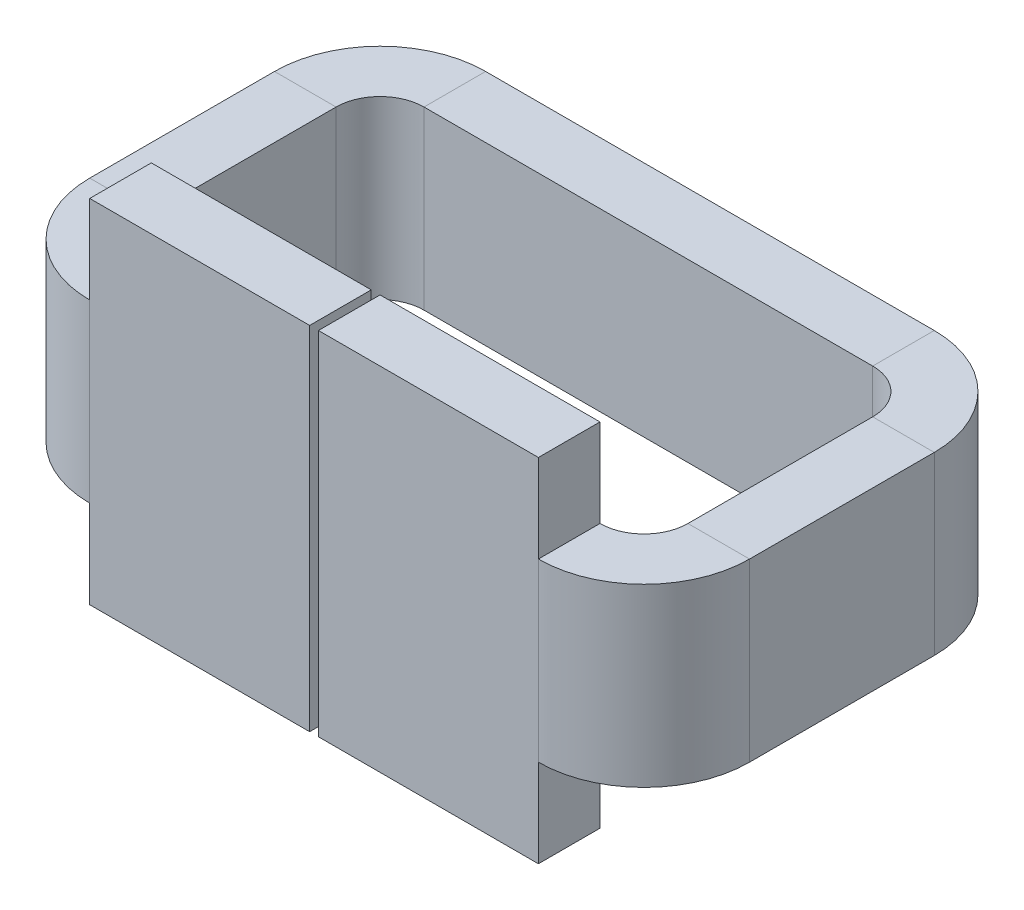
ISO-10303-21;
HEADER;
FILE_DESCRIPTION(('STEP AP214'),'2;1');
FILE_NAME('part.step','',(''),(''),'','','');
FILE_SCHEMA(('AUTOMOTIVE_DESIGN { 1 0 10303 214 1 1 1 1 }'));
ENDSEC;
DATA;
#1=APPLICATION_CONTEXT('core data for automotive mechanical design processes');
#2=APPLICATION_PROTOCOL_DEFINITION('international standard','automotive_design',2000,#1);
#3=PRODUCT_CONTEXT('',#1,'mechanical');
#4=PRODUCT('Part','Part','',(#3));
#5=PRODUCT_RELATED_PRODUCT_CATEGORY('part','',(#4));
#6=PRODUCT_DEFINITION_FORMATION('','',#4);
#7=PRODUCT_DEFINITION_CONTEXT('part definition',#1,'design');
#8=PRODUCT_DEFINITION('design','',#6,#7);
#9=PRODUCT_DEFINITION_SHAPE('','',#8);
#10=(LENGTH_UNIT() NAMED_UNIT(*) SI_UNIT(.MILLI.,.METRE.));
#11=(NAMED_UNIT(*) PLANE_ANGLE_UNIT() SI_UNIT($,.RADIAN.));
#12=(NAMED_UNIT(*) SI_UNIT($,.STERADIAN.) SOLID_ANGLE_UNIT());
#13=UNCERTAINTY_MEASURE_WITH_UNIT(LENGTH_MEASURE(1.E-05),#10,'distance_accuracy_value','');
#14=(GEOMETRIC_REPRESENTATION_CONTEXT(3) GLOBAL_UNCERTAINTY_ASSIGNED_CONTEXT((#13)) GLOBAL_UNIT_ASSIGNED_CONTEXT((#10,
#11,#12)) REPRESENTATION_CONTEXT('',''));
#15=CARTESIAN_POINT('',(0.,0.,0.));
#16=DIRECTION('',(0.,0.,1.));
#17=DIRECTION('',(1.,0.,0.));
#18=AXIS2_PLACEMENT_3D('',#15,#16,#17);
#19=CARTESIAN_POINT('',(3.7186584278201,0.50894488,-3.90652));
#20=DIRECTION('',(0.,-1.,0.));
#21=DIRECTION('',(1.,0.,0.));
#22=AXIS2_PLACEMENT_3D('',#19,#20,#21);
#23=PLANE('',#22);
#24=DIRECTION('',(0.,0.,-1.));
#25=VECTOR('',#24,1.);
#26=CARTESIAN_POINT('',(-1.29548128,0.508944879999999,-3.55092));
#27=LINE('',#26,#25);
#28=CARTESIAN_POINT('',(-1.29548128,0.508944879999999,-3.55092));
#29=VERTEX_POINT('',#28);
#30=CARTESIAN_POINT('',(-1.29548128,0.508944879999999,-3.90652));
#31=VERTEX_POINT('',#30);
#32=EDGE_CURVE('E10',#29,#31,#27,.T.);
#33=ORIENTED_EDGE('',*,*,#32,.F.);
#34=DIRECTION('',(1.,0.,0.));
#35=VECTOR('',#34,1.);
#36=CARTESIAN_POINT('',(3.7186584278201,0.50894488,-3.55092));
#37=LINE('',#36,#35);
#38=CARTESIAN_POINT('',(1.29531872,0.508944879999999,-3.55092));
#39=VERTEX_POINT('',#38);
#40=EDGE_CURVE('E23',#29,#39,#37,.T.);
#41=ORIENTED_EDGE('',*,*,#40,.T.);
#42=DIRECTION('',(0.,0.,1.));
#43=VECTOR('',#42,1.);
#44=CARTESIAN_POINT('',(1.29531872,0.508944879999999,-3.90652));
#45=LINE('',#44,#43);
#46=CARTESIAN_POINT('',(1.29531872,0.508944879999999,-3.90652));
#47=VERTEX_POINT('',#46);
#48=EDGE_CURVE('E411',#47,#39,#45,.T.);
#49=ORIENTED_EDGE('',*,*,#48,.F.);
#50=DIRECTION('',(1.,0.,0.));
#51=VECTOR('',#50,1.);
#52=CARTESIAN_POINT('',(3.7186584278201,0.50894488,-3.90652));
#53=LINE('',#52,#51);
#54=EDGE_CURVE('E408',#31,#47,#53,.T.);
#55=ORIENTED_EDGE('',*,*,#54,.F.);
#56=EDGE_LOOP('',(#33,#41,#49,#55));
#57=FACE_BOUND('',#56,.T.);
#58=ADVANCED_FACE('F16',(#57),#23,.F.);
#59=CARTESIAN_POINT('',(3.7186584278201,-0.507055120000001,-3.90652));
#60=DIRECTION('',(0.,1.,0.));
#61=DIRECTION('',(-1.,0.,0.));
#62=AXIS2_PLACEMENT_3D('',#59,#60,#61);
#63=PLANE('',#62);
#64=DIRECTION('',(0.,0.,1.));
#65=VECTOR('',#64,1.);
#66=CARTESIAN_POINT('',(-1.29548128,-0.507055120000001,-3.90652));
#67=LINE('',#66,#65);
#68=CARTESIAN_POINT('',(-1.29548128,-0.507055120000001,-3.90652));
#69=VERTEX_POINT('',#68);
#70=CARTESIAN_POINT('',(-1.29548128,-0.507055120000001,-3.55092));
#71=VERTEX_POINT('',#70);
#72=EDGE_CURVE('E405',#69,#71,#67,.T.);
#73=ORIENTED_EDGE('',*,*,#72,.F.);
#74=DIRECTION('',(-1.,0.,0.));
#75=VECTOR('',#74,1.);
#76=CARTESIAN_POINT('',(3.7186584278201,-0.507055120000001,-3.90652));
#77=LINE('',#76,#75);
#78=CARTESIAN_POINT('',(1.29531872,-0.507055120000001,-3.90652));
#79=VERTEX_POINT('',#78);
#80=EDGE_CURVE('E403',#79,#69,#77,.T.);
#81=ORIENTED_EDGE('',*,*,#80,.F.);
#82=DIRECTION('',(0.,0.,-1.));
#83=VECTOR('',#82,1.);
#84=CARTESIAN_POINT('',(1.29531872,-0.507055120000001,-3.55092));
#85=LINE('',#84,#83);
#86=CARTESIAN_POINT('',(1.29531872,-0.507055120000001,-3.55092));
#87=VERTEX_POINT('',#86);
#88=EDGE_CURVE('E400',#87,#79,#85,.T.);
#89=ORIENTED_EDGE('',*,*,#88,.F.);
#90=DIRECTION('',(-1.,0.,0.));
#91=VECTOR('',#90,1.);
#92=CARTESIAN_POINT('',(3.7186584278201,-0.50705512,-3.55092));
#93=LINE('',#92,#91);
#94=EDGE_CURVE('E397',#87,#71,#93,.T.);
#95=ORIENTED_EDGE('',*,*,#94,.T.);
#96=EDGE_LOOP('',(#73,#81,#89,#95));
#97=FACE_BOUND('',#96,.T.);
#98=ADVANCED_FACE('F468',(#97),#63,.F.);
#99=CARTESIAN_POINT('',(1.29531872,1.01694488,-3.90652));
#100=DIRECTION('',(0.,0.,-1.));
#101=DIRECTION('',(-1.,0.,0.));
#102=AXIS2_PLACEMENT_3D('',#99,#100,#101);
#103=PLANE('',#102);
#104=ORIENTED_EDGE('',*,*,#80,.T.);
#105=DIRECTION('',(0.,-1.,0.));
#106=VECTOR('',#105,1.);
#107=CARTESIAN_POINT('',(-1.29548128,1.01694488,-3.90652));
#108=LINE('',#107,#106);
#109=EDGE_CURVE('E394',#31,#69,#108,.T.);
#110=ORIENTED_EDGE('',*,*,#109,.F.);
#111=ORIENTED_EDGE('',*,*,#54,.T.);
#112=DIRECTION('',(0.,-1.,0.));
#113=VECTOR('',#112,1.);
#114=CARTESIAN_POINT('',(1.29531872,1.01694488,-3.90652));
#115=LINE('',#114,#113);
#116=EDGE_CURVE('E391',#47,#79,#115,.T.);
#117=ORIENTED_EDGE('',*,*,#116,.T.);
#118=EDGE_LOOP('',(#104,#110,#111,#117));
#119=FACE_BOUND('',#118,.T.);
#120=ADVANCED_FACE('F444',(#119),#103,.T.);
#121=CARTESIAN_POINT('',(1.29531872,1.01694488,-3.55092));
#122=DIRECTION('',(0.,0.,-1.));
#123=DIRECTION('',(-1.,0.,0.));
#124=AXIS2_PLACEMENT_3D('',#121,#122,#123);
#125=PLANE('',#124);
#126=DIRECTION('',(0.,-1.,0.));
#127=VECTOR('',#126,1.);
#128=CARTESIAN_POINT('',(-1.29548128,1.01694488,-3.55092));
#129=LINE('',#128,#127);
#130=EDGE_CURVE('E388',#29,#71,#129,.T.);
#131=ORIENTED_EDGE('',*,*,#130,.T.);
#132=ORIENTED_EDGE('',*,*,#94,.F.);
#133=DIRECTION('',(0.,-1.,0.));
#134=VECTOR('',#133,1.);
#135=CARTESIAN_POINT('',(1.29531872,1.01694488,-3.55092));
#136=LINE('',#135,#134);
#137=EDGE_CURVE('E386',#39,#87,#136,.T.);
#138=ORIENTED_EDGE('',*,*,#137,.F.);
#139=ORIENTED_EDGE('',*,*,#40,.F.);
#140=EDGE_LOOP('',(#131,#132,#138,#139));
#141=FACE_BOUND('',#140,.T.);
#142=ADVANCED_FACE('F420',(#141),#125,.F.);
#143=CARTESIAN_POINT('',(0.0253187200000003,1.01694488,-1.62052));
#144=DIRECTION('',(-1.,0.,0.));
#145=DIRECTION('',(0.,0.,1.));
#146=AXIS2_PLACEMENT_3D('',#143,#144,#145);
#147=PLANE('',#146);
#148=DIRECTION('',(0.,0.,-1.));
#149=VECTOR('',#148,1.);
#150=CARTESIAN_POINT('',(0.0253187200000003,-1.01505512,-1.62052));
#151=LINE('',#150,#149);
#152=CARTESIAN_POINT('',(0.0253187200000003,-1.01505512,-1.62052));
#153=VERTEX_POINT('',#152);
#154=CARTESIAN_POINT('',(0.0253187200000002,-1.01505512,-1.97612));
#155=VERTEX_POINT('',#154);
#156=EDGE_CURVE('E383',#153,#155,#151,.T.);
#157=ORIENTED_EDGE('',*,*,#156,.F.);
#158=DIRECTION('',(0.,-1.,0.));
#159=VECTOR('',#158,1.);
#160=CARTESIAN_POINT('',(0.0253187200000003,1.01694488,-1.62052));
#161=LINE('',#160,#159);
#162=CARTESIAN_POINT('',(0.0253187200000003,1.01694488,-1.62052));
#163=VERTEX_POINT('',#162);
#164=EDGE_CURVE('E381',#163,#153,#161,.T.);
#165=ORIENTED_EDGE('',*,*,#164,.F.);
#166=DIRECTION('',(0.,0.,-1.));
#167=VECTOR('',#166,1.);
#168=CARTESIAN_POINT('',(0.0253187200000003,1.01694488,-1.62052));
#169=LINE('',#168,#167);
#170=CARTESIAN_POINT('',(0.0253187200000002,1.01694488,-1.97612));
#171=VERTEX_POINT('',#170);
#172=EDGE_CURVE('E379',#163,#171,#169,.T.);
#173=ORIENTED_EDGE('',*,*,#172,.T.);
#174=DIRECTION('',(0.,-1.,0.));
#175=VECTOR('',#174,1.);
#176=CARTESIAN_POINT('',(0.0253187200000002,1.01694488,-1.97612));
#177=LINE('',#176,#175);
#178=EDGE_CURVE('E376',#171,#155,#177,.T.);
#179=ORIENTED_EDGE('',*,*,#178,.T.);
#180=EDGE_LOOP('',(#157,#165,#173,#179));
#181=FACE_BOUND('',#180,.T.);
#182=ADVANCED_FACE('F525',(#181),#147,.T.);
#183=CARTESIAN_POINT('',(1.54931872,1.01694488,-2.23012));
#184=DIRECTION('',(0.,1.,0.));
#185=DIRECTION('',(1.,0.,0.));
#186=AXIS2_PLACEMENT_3D('',#183,#184,#185);
#187=PLANE('',#186);
#188=DIRECTION('',(-1.,0.,0.));
#189=VECTOR('',#188,1.);
#190=CARTESIAN_POINT('',(0.0253187200000003,1.01694488,-1.62052));
#191=LINE('',#190,#189);
#192=CARTESIAN_POINT('',(1.29531872,1.01694488,-1.62052));
#193=VERTEX_POINT('',#192);
#194=EDGE_CURVE('E374',#193,#163,#191,.T.);
#195=ORIENTED_EDGE('',*,*,#194,.F.);
#196=DIRECTION('',(0.,0.,-1.));
#197=VECTOR('',#196,1.);
#198=CARTESIAN_POINT('',(1.29531872,1.01694488,-1.62052));
#199=LINE('',#198,#197);
#200=CARTESIAN_POINT('',(1.29531872,1.01694488,-1.97612));
#201=VERTEX_POINT('',#200);
#202=EDGE_CURVE('E372',#193,#201,#199,.T.);
#203=ORIENTED_EDGE('',*,*,#202,.T.);
#204=DIRECTION('',(-1.,0.,0.));
#205=VECTOR('',#204,1.);
#206=CARTESIAN_POINT('',(0.0253187200000002,1.01694488,-1.97612));
#207=LINE('',#206,#205);
#208=EDGE_CURVE('E369',#201,#171,#207,.T.);
#209=ORIENTED_EDGE('',*,*,#208,.T.);
#210=ORIENTED_EDGE('',*,*,#172,.F.);
#211=EDGE_LOOP('',(#195,#203,#209,#210));
#212=FACE_BOUND('',#211,.T.);
#213=ADVANCED_FACE('F528',(#212),#187,.T.);
#214=CARTESIAN_POINT('',(1.29531872,-1.01505512,-2.23012));
#215=DIRECTION('',(0.,-1.,0.));
#216=DIRECTION('',(-1.,0.,0.));
#217=AXIS2_PLACEMENT_3D('',#214,#215,#216);
#218=PLANE('',#217);
#219=DIRECTION('',(-1.,0.,0.));
#220=VECTOR('',#219,1.);
#221=CARTESIAN_POINT('',(0.0253187200000002,-1.01505512,-1.97612));
#222=LINE('',#221,#220);
#223=CARTESIAN_POINT('',(1.29531872,-1.01505512,-1.97612));
#224=VERTEX_POINT('',#223);
#225=EDGE_CURVE('E367',#224,#155,#222,.T.);
#226=ORIENTED_EDGE('',*,*,#225,.F.);
#227=DIRECTION('',(0.,0.,1.));
#228=VECTOR('',#227,1.);
#229=CARTESIAN_POINT('',(1.29531872,-1.01505512,-1.97612));
#230=LINE('',#229,#228);
#231=CARTESIAN_POINT('',(1.29531872,-1.01505512,-1.62052));
#232=VERTEX_POINT('',#231);
#233=EDGE_CURVE('E365',#224,#232,#230,.T.);
#234=ORIENTED_EDGE('',*,*,#233,.T.);
#235=DIRECTION('',(-1.,0.,0.));
#236=VECTOR('',#235,1.);
#237=CARTESIAN_POINT('',(0.0253187200000003,-1.01505512,-1.62052));
#238=LINE('',#237,#236);
#239=EDGE_CURVE('E362',#232,#153,#238,.T.);
#240=ORIENTED_EDGE('',*,*,#239,.T.);
#241=ORIENTED_EDGE('',*,*,#156,.T.);
#242=EDGE_LOOP('',(#226,#234,#240,#241));
#243=FACE_BOUND('',#242,.T.);
#244=ADVANCED_FACE('F532',(#243),#218,.T.);
#245=CARTESIAN_POINT('',(1.29531872,-1.01505512,-1.62052));
#246=DIRECTION('',(-1.,0.,0.));
#247=DIRECTION('',(0.,1.,0.));
#248=AXIS2_PLACEMENT_3D('',#245,#246,#247);
#249=PLANE('',#248);
#250=DIRECTION('',(0.,1.,0.));
#251=VECTOR('',#250,1.);
#252=CARTESIAN_POINT('',(1.29531872,-1.01505512,-1.97612));
#253=LINE('',#252,#251);
#254=CARTESIAN_POINT('',(1.29531872,-0.50705512,-1.97612));
#255=VERTEX_POINT('',#254);
#256=EDGE_CURVE('E360',#224,#255,#253,.T.);
#257=ORIENTED_EDGE('',*,*,#256,.T.);
#258=DIRECTION('',(0.,0.,-1.));
#259=VECTOR('',#258,1.);
#260=CARTESIAN_POINT('',(1.29531872,-0.50705512,-1.62052));
#261=LINE('',#260,#259);
#262=CARTESIAN_POINT('',(1.29531872,-0.50705512,-1.62052));
#263=VERTEX_POINT('',#262);
#264=EDGE_CURVE('E357',#263,#255,#261,.T.);
#265=ORIENTED_EDGE('',*,*,#264,.F.);
#266=DIRECTION('',(0.,1.,0.));
#267=VECTOR('',#266,1.);
#268=CARTESIAN_POINT('',(1.29531872,-1.01505512,-1.62052));
#269=LINE('',#268,#267);
#270=EDGE_CURVE('E354',#232,#263,#269,.T.);
#271=ORIENTED_EDGE('',*,*,#270,.F.);
#272=ORIENTED_EDGE('',*,*,#233,.F.);
#273=EDGE_LOOP('',(#257,#265,#271,#272));
#274=FACE_BOUND('',#273,.T.);
#275=ADVANCED_FACE('F489',(#274),#249,.F.);
#276=CARTESIAN_POINT('',(0.0253187200000002,1.01694488,-1.97612));
#277=DIRECTION('',(0.,0.,1.));
#278=DIRECTION('',(1.,0.,0.));
#279=AXIS2_PLACEMENT_3D('',#276,#277,#278);
#280=PLANE('',#279);
#281=ORIENTED_EDGE('',*,*,#225,.T.);
#282=ORIENTED_EDGE('',*,*,#178,.F.);
#283=ORIENTED_EDGE('',*,*,#208,.F.);
#284=DIRECTION('',(0.,-1.,0.));
#285=VECTOR('',#284,1.);
#286=CARTESIAN_POINT('',(1.29531872,1.01694488,-1.97612));
#287=LINE('',#286,#285);
#288=CARTESIAN_POINT('',(1.29531872,0.50894488,-1.97612));
#289=VERTEX_POINT('',#288);
#290=EDGE_CURVE('E351',#201,#289,#287,.T.);
#291=ORIENTED_EDGE('',*,*,#290,.T.);
#292=DIRECTION('',(0.,-1.,0.));
#293=VECTOR('',#292,1.);
#294=CARTESIAN_POINT('',(1.29531872,1.01694488,-1.97612));
#295=LINE('',#294,#293);
#296=EDGE_CURVE('E348',#289,#255,#295,.T.);
#297=ORIENTED_EDGE('',*,*,#296,.T.);
#298=ORIENTED_EDGE('',*,*,#256,.F.);
#299=EDGE_LOOP('',(#281,#282,#283,#291,#297,#298));
#300=FACE_BOUND('',#299,.T.);
#301=ADVANCED_FACE('F494',(#300),#280,.F.);
#302=CARTESIAN_POINT('',(1.29531872,1.01694488,-1.62052));
#303=DIRECTION('',(-1.,0.,0.));
#304=DIRECTION('',(0.,1.,0.));
#305=AXIS2_PLACEMENT_3D('',#302,#303,#304);
#306=PLANE('',#305);
#307=ORIENTED_EDGE('',*,*,#290,.F.);
#308=ORIENTED_EDGE('',*,*,#202,.F.);
#309=DIRECTION('',(0.,-1.,0.));
#310=VECTOR('',#309,1.);
#311=CARTESIAN_POINT('',(1.29531872,1.01694488,-1.62052));
#312=LINE('',#311,#310);
#313=CARTESIAN_POINT('',(1.29531872,0.50894488,-1.62052));
#314=VERTEX_POINT('',#313);
#315=EDGE_CURVE('E346',#193,#314,#312,.T.);
#316=ORIENTED_EDGE('',*,*,#315,.T.);
#317=DIRECTION('',(0.,0.,-1.));
#318=VECTOR('',#317,1.);
#319=CARTESIAN_POINT('',(1.29531872,0.50894488,-1.62052));
#320=LINE('',#319,#318);
#321=EDGE_CURVE('E344',#314,#289,#320,.T.);
#322=ORIENTED_EDGE('',*,*,#321,.T.);
#323=EDGE_LOOP('',(#307,#308,#316,#322));
#324=FACE_BOUND('',#323,.T.);
#325=ADVANCED_FACE('F501',(#324),#306,.F.);
#326=CARTESIAN_POINT('',(0.0253187200000003,1.01694488,-1.62052));
#327=DIRECTION('',(0.,0.,1.));
#328=DIRECTION('',(1.,0.,0.));
#329=AXIS2_PLACEMENT_3D('',#326,#327,#328);
#330=PLANE('',#329);
#331=ORIENTED_EDGE('',*,*,#239,.F.);
#332=ORIENTED_EDGE('',*,*,#270,.T.);
#333=DIRECTION('',(0.,-1.,0.));
#334=VECTOR('',#333,1.);
#335=CARTESIAN_POINT('',(1.29531872,1.01694488,-1.62052));
#336=LINE('',#335,#334);
#337=EDGE_CURVE('E341',#314,#263,#336,.T.);
#338=ORIENTED_EDGE('',*,*,#337,.F.);
#339=ORIENTED_EDGE('',*,*,#315,.F.);
#340=ORIENTED_EDGE('',*,*,#194,.T.);
#341=ORIENTED_EDGE('',*,*,#164,.T.);
#342=EDGE_LOOP('',(#331,#332,#338,#339,#340,#341));
#343=FACE_BOUND('',#342,.T.);
#344=ADVANCED_FACE('F485',(#343),#330,.T.);
#345=CARTESIAN_POINT('',(1.29531872,-0.50705512,-2.23012));
#346=DIRECTION('',(0.,-1.,0.));
#347=DIRECTION('',(-1.,0.,0.));
#348=AXIS2_PLACEMENT_3D('',#345,#346,#347);
#349=PLANE('',#348);
#350=ORIENTED_EDGE('',*,*,#264,.T.);
#351=CARTESIAN_POINT('',(1.29531872,-0.50705512,-2.23012));
#352=DIRECTION('',(0.,1.,0.));
#353=DIRECTION('',(1.,0.,0.));
#354=AXIS2_PLACEMENT_3D('',#351,#352,#353);
#355=CIRCLE('',#354,0.254);
#356=CARTESIAN_POINT('',(1.54931872,-0.50705512,-2.23012));
#357=VERTEX_POINT('',#356);
#358=EDGE_CURVE('E338',#255,#357,#355,.T.);
#359=ORIENTED_EDGE('',*,*,#358,.T.);
#360=DIRECTION('',(1.,0.,0.));
#361=VECTOR('',#360,1.);
#362=CARTESIAN_POINT('',(1.54931872,-0.50705512,-2.23012));
#363=LINE('',#362,#361);
#364=CARTESIAN_POINT('',(1.90491872,-0.50705512,-2.23012));
#365=VERTEX_POINT('',#364);
#366=EDGE_CURVE('E335',#357,#365,#363,.T.);
#367=ORIENTED_EDGE('',*,*,#366,.T.);
#368=CARTESIAN_POINT('',(1.29531872,-0.50705512,-2.23012));
#369=DIRECTION('',(0.,1.,0.));
#370=DIRECTION('',(1.,0.,0.));
#371=AXIS2_PLACEMENT_3D('',#368,#369,#370);
#372=CIRCLE('',#371,0.6096);
#373=EDGE_CURVE('E332',#263,#365,#372,.T.);
#374=ORIENTED_EDGE('',*,*,#373,.F.);
#375=EDGE_LOOP('',(#350,#359,#367,#374));
#376=FACE_BOUND('',#375,.T.);
#377=ADVANCED_FACE('F476',(#376),#349,.T.);
#378=CARTESIAN_POINT('',(1.29531872,-1.2713590753201,-2.23012));
#379=DIRECTION('',(0.,1.,0.));
#380=DIRECTION('',(1.,0.,0.));
#381=AXIS2_PLACEMENT_3D('',#378,#379,#380);
#382=CYLINDRICAL_SURFACE('',#381,0.254);
#383=CARTESIAN_POINT('',(1.29531872,0.50894488,-2.23012));
#384=DIRECTION('',(0.,-1.,0.));
#385=DIRECTION('',(1.,0.,0.));
#386=AXIS2_PLACEMENT_3D('',#383,#384,#385);
#387=CIRCLE('',#386,0.254);
#388=CARTESIAN_POINT('',(1.54931872,0.50894488,-2.23012));
#389=VERTEX_POINT('',#388);
#390=EDGE_CURVE('E329',#389,#289,#387,.T.);
#391=ORIENTED_EDGE('',*,*,#390,.F.);
#392=DIRECTION('',(0.,-1.,0.));
#393=VECTOR('',#392,1.);
#394=CARTESIAN_POINT('',(1.54931872,1.01694488,-2.23012));
#395=LINE('',#394,#393);
#396=EDGE_CURVE('E326',#389,#357,#395,.T.);
#397=ORIENTED_EDGE('',*,*,#396,.T.);
#398=ORIENTED_EDGE('',*,*,#358,.F.);
#399=ORIENTED_EDGE('',*,*,#296,.F.);
#400=EDGE_LOOP('',(#391,#397,#398,#399));
#401=FACE_BOUND('',#400,.T.);
#402=ADVANCED_FACE('F492',(#401),#382,.F.);
#403=CARTESIAN_POINT('',(1.29531872,0.50894488,-2.23012));
#404=DIRECTION('',(0.,1.,0.));
#405=DIRECTION('',(1.,0.,0.));
#406=AXIS2_PLACEMENT_3D('',#403,#404,#405);
#407=PLANE('',#406);
#408=DIRECTION('',(-1.,0.,0.));
#409=VECTOR('',#408,1.);
#410=CARTESIAN_POINT('',(1.90491872,0.50894488,-2.23012));
#411=LINE('',#410,#409);
#412=CARTESIAN_POINT('',(1.90491872,0.50894488,-2.23012));
#413=VERTEX_POINT('',#412);
#414=EDGE_CURVE('E324',#413,#389,#411,.T.);
#415=ORIENTED_EDGE('',*,*,#414,.T.);
#416=ORIENTED_EDGE('',*,*,#390,.T.);
#417=ORIENTED_EDGE('',*,*,#321,.F.);
#418=CARTESIAN_POINT('',(1.29531872,0.50894488,-2.23012));
#419=DIRECTION('',(0.,-1.,0.));
#420=DIRECTION('',(-1.,0.,0.));
#421=AXIS2_PLACEMENT_3D('',#418,#419,#420);
#422=CIRCLE('',#421,0.6096);
#423=EDGE_CURVE('E321',#413,#314,#422,.T.);
#424=ORIENTED_EDGE('',*,*,#423,.F.);
#425=EDGE_LOOP('',(#415,#416,#417,#424));
#426=FACE_BOUND('',#425,.T.);
#427=ADVANCED_FACE('F504',(#426),#407,.T.);
#428=CARTESIAN_POINT('',(1.29531872,-1.2713590753201,-2.23012));
#429=DIRECTION('',(0.,1.,0.));
#430=DIRECTION('',(1.,0.,0.));
#431=AXIS2_PLACEMENT_3D('',#428,#429,#430);
#432=CYLINDRICAL_SURFACE('',#431,0.6096);
#433=ORIENTED_EDGE('',*,*,#423,.T.);
#434=ORIENTED_EDGE('',*,*,#337,.T.);
#435=ORIENTED_EDGE('',*,*,#373,.T.);
#436=DIRECTION('',(0.,-1.,0.));
#437=VECTOR('',#436,1.);
#438=CARTESIAN_POINT('',(1.90491872,1.01694488,-2.23012));
#439=LINE('',#438,#437);
#440=EDGE_CURVE('E318',#413,#365,#439,.T.);
#441=ORIENTED_EDGE('',*,*,#440,.F.);
#442=EDGE_LOOP('',(#433,#434,#435,#441));
#443=FACE_BOUND('',#442,.T.);
#444=ADVANCED_FACE('F480',(#443),#432,.T.);
#445=CARTESIAN_POINT('',(1.90491872,1.01694488,-2.23012));
#446=DIRECTION('',(1.,0.,0.));
#447=DIRECTION('',(0.,0.,-1.));
#448=AXIS2_PLACEMENT_3D('',#445,#446,#447);
#449=PLANE('',#448);
#450=DIRECTION('',(0.,0.,-1.));
#451=VECTOR('',#450,1.);
#452=CARTESIAN_POINT('',(1.90491872,-0.50705512,-1.55185014609));
#453=LINE('',#452,#451);
#454=CARTESIAN_POINT('',(1.90491872,-0.507055120000001,-3.29692));
#455=VERTEX_POINT('',#454);
#456=EDGE_CURVE('E316',#365,#455,#453,.T.);
#457=ORIENTED_EDGE('',*,*,#456,.T.);
#458=DIRECTION('',(0.,-1.,0.));
#459=VECTOR('',#458,1.);
#460=CARTESIAN_POINT('',(1.90491872,1.01694488,-3.29692));
#461=LINE('',#460,#459);
#462=CARTESIAN_POINT('',(1.90491872,0.508944879999999,-3.29692));
#463=VERTEX_POINT('',#462);
#464=EDGE_CURVE('E313',#463,#455,#461,.T.);
#465=ORIENTED_EDGE('',*,*,#464,.F.);
#466=DIRECTION('',(0.,0.,1.));
#467=VECTOR('',#466,1.);
#468=CARTESIAN_POINT('',(1.90491872,0.50894488,-1.55185014609));
#469=LINE('',#468,#467);
#470=EDGE_CURVE('E310',#463,#413,#469,.T.);
#471=ORIENTED_EDGE('',*,*,#470,.T.);
#472=ORIENTED_EDGE('',*,*,#440,.T.);
#473=EDGE_LOOP('',(#457,#465,#471,#472));
#474=FACE_BOUND('',#473,.T.);
#475=ADVANCED_FACE('F437',(#474),#449,.T.);
#476=CARTESIAN_POINT('',(1.90491872,0.50894488,-1.55185014609));
#477=DIRECTION('',(0.,-1.,0.));
#478=DIRECTION('',(0.,0.,1.));
#479=AXIS2_PLACEMENT_3D('',#476,#477,#478);
#480=PLANE('',#479);
#481=DIRECTION('',(1.,0.,0.));
#482=VECTOR('',#481,1.);
#483=CARTESIAN_POINT('',(1.54931872,0.50894488,-3.29692));
#484=LINE('',#483,#482);
#485=CARTESIAN_POINT('',(1.54931872,0.50894488,-3.29692));
#486=VERTEX_POINT('',#485);
#487=EDGE_CURVE('E308',#486,#463,#484,.T.);
#488=ORIENTED_EDGE('',*,*,#487,.F.);
#489=DIRECTION('',(0.,0.,1.));
#490=VECTOR('',#489,1.);
#491=CARTESIAN_POINT('',(1.54931872,0.50894488,-1.55185014609));
#492=LINE('',#491,#490);
#493=EDGE_CURVE('E305',#486,#389,#492,.T.);
#494=ORIENTED_EDGE('',*,*,#493,.T.);
#495=ORIENTED_EDGE('',*,*,#414,.F.);
#496=ORIENTED_EDGE('',*,*,#470,.F.);
#497=EDGE_LOOP('',(#488,#494,#495,#496));
#498=FACE_BOUND('',#497,.T.);
#499=ADVANCED_FACE('F432',(#498),#480,.F.);
#500=CARTESIAN_POINT('',(1.54931872,1.01694488,-2.23012));
#501=DIRECTION('',(1.,0.,0.));
#502=DIRECTION('',(0.,0.,-1.));
#503=AXIS2_PLACEMENT_3D('',#500,#501,#502);
#504=PLANE('',#503);
#505=DIRECTION('',(0.,-1.,0.));
#506=VECTOR('',#505,1.);
#507=CARTESIAN_POINT('',(1.54931872,1.01694488,-3.29692));
#508=LINE('',#507,#506);
#509=CARTESIAN_POINT('',(1.54931872,-0.507055120000001,-3.29692));
#510=VERTEX_POINT('',#509);
#511=EDGE_CURVE('E302',#486,#510,#508,.T.);
#512=ORIENTED_EDGE('',*,*,#511,.T.);
#513=DIRECTION('',(0.,0.,-1.));
#514=VECTOR('',#513,1.);
#515=CARTESIAN_POINT('',(1.54931872,-0.50705512,-1.55185014609));
#516=LINE('',#515,#514);
#517=EDGE_CURVE('E300',#357,#510,#516,.T.);
#518=ORIENTED_EDGE('',*,*,#517,.F.);
#519=ORIENTED_EDGE('',*,*,#396,.F.);
#520=ORIENTED_EDGE('',*,*,#493,.F.);
#521=EDGE_LOOP('',(#512,#518,#519,#520));
#522=FACE_BOUND('',#521,.T.);
#523=ADVANCED_FACE('F428',(#522),#504,.F.);
#524=CARTESIAN_POINT('',(1.90491872,-0.50705512,-1.55185014609));
#525=DIRECTION('',(0.,1.,0.));
#526=DIRECTION('',(0.,0.,-1.));
#527=AXIS2_PLACEMENT_3D('',#524,#525,#526);
#528=PLANE('',#527);
#529=DIRECTION('',(-1.,0.,0.));
#530=VECTOR('',#529,1.);
#531=CARTESIAN_POINT('',(1.90491872,-0.507055120000001,-3.29692));
#532=LINE('',#531,#530);
#533=EDGE_CURVE('E297',#455,#510,#532,.T.);
#534=ORIENTED_EDGE('',*,*,#533,.F.);
#535=ORIENTED_EDGE('',*,*,#456,.F.);
#536=ORIENTED_EDGE('',*,*,#366,.F.);
#537=ORIENTED_EDGE('',*,*,#517,.T.);
#538=EDGE_LOOP('',(#534,#535,#536,#537));
#539=FACE_BOUND('',#538,.T.);
#540=ADVANCED_FACE('F472',(#539),#528,.F.);
#541=CARTESIAN_POINT('',(1.29531872,-0.507055120000001,-3.29692));
#542=DIRECTION('',(0.,-1.,0.));
#543=DIRECTION('',(-1.,0.,0.));
#544=AXIS2_PLACEMENT_3D('',#541,#542,#543);
#545=PLANE('',#544);
#546=ORIENTED_EDGE('',*,*,#533,.T.);
#547=CARTESIAN_POINT('',(1.29531872,-0.507055120000001,-3.29692));
#548=DIRECTION('',(0.,1.,0.));
#549=DIRECTION('',(1.,0.,0.));
#550=AXIS2_PLACEMENT_3D('',#547,#548,#549);
#551=CIRCLE('',#550,0.254);
#552=EDGE_CURVE('E294',#510,#87,#551,.T.);
#553=ORIENTED_EDGE('',*,*,#552,.T.);
#554=ORIENTED_EDGE('',*,*,#88,.T.);
#555=CARTESIAN_POINT('',(1.29531872,-0.507055120000001,-3.29692));
#556=DIRECTION('',(0.,1.,0.));
#557=DIRECTION('',(1.,0.,0.));
#558=AXIS2_PLACEMENT_3D('',#555,#556,#557);
#559=CIRCLE('',#558,0.6096);
#560=EDGE_CURVE('E291',#455,#79,#559,.T.);
#561=ORIENTED_EDGE('',*,*,#560,.F.);
#562=EDGE_LOOP('',(#546,#553,#554,#561));
#563=FACE_BOUND('',#562,.T.);
#564=ADVANCED_FACE('F470',(#563),#545,.T.);
#565=CARTESIAN_POINT('',(1.29531872,0.508944879999999,-3.29692));
#566=DIRECTION('',(0.,1.,0.));
#567=DIRECTION('',(1.,0.,0.));
#568=AXIS2_PLACEMENT_3D('',#565,#566,#567);
#569=PLANE('',#568);
#570=ORIENTED_EDGE('',*,*,#48,.T.);
#571=CARTESIAN_POINT('',(1.29531872,0.508944879999999,-3.29692));
#572=DIRECTION('',(0.,-1.,0.));
#573=DIRECTION('',(1.,0.,0.));
#574=AXIS2_PLACEMENT_3D('',#571,#572,#573);
#575=CIRCLE('',#574,0.254);
#576=EDGE_CURVE('E288',#39,#486,#575,.T.);
#577=ORIENTED_EDGE('',*,*,#576,.T.);
#578=ORIENTED_EDGE('',*,*,#487,.T.);
#579=CARTESIAN_POINT('',(1.29531872,0.508944879999999,-3.29692));
#580=DIRECTION('',(0.,-1.,0.));
#581=DIRECTION('',(-1.,0.,0.));
#582=AXIS2_PLACEMENT_3D('',#579,#580,#581);
#583=CIRCLE('',#582,0.6096);
#584=EDGE_CURVE('E285',#47,#463,#583,.T.);
#585=ORIENTED_EDGE('',*,*,#584,.F.);
#586=EDGE_LOOP('',(#570,#577,#578,#585));
#587=FACE_BOUND('',#586,.T.);
#588=ADVANCED_FACE('F417',(#587),#569,.T.);
#589=CARTESIAN_POINT('',(1.29531872,-1.2713590753201,-3.29692));
#590=DIRECTION('',(0.,1.,0.));
#591=DIRECTION('',(1.,0.,0.));
#592=AXIS2_PLACEMENT_3D('',#589,#590,#591);
#593=CYLINDRICAL_SURFACE('',#592,0.6096);
#594=ORIENTED_EDGE('',*,*,#584,.T.);
#595=ORIENTED_EDGE('',*,*,#464,.T.);
#596=ORIENTED_EDGE('',*,*,#560,.T.);
#597=ORIENTED_EDGE('',*,*,#116,.F.);
#598=EDGE_LOOP('',(#594,#595,#596,#597));
#599=FACE_BOUND('',#598,.T.);
#600=ADVANCED_FACE('F441',(#599),#593,.T.);
#601=CARTESIAN_POINT('',(1.29531872,-1.2713590753201,-3.29692));
#602=DIRECTION('',(0.,1.,0.));
#603=DIRECTION('',(1.,0.,0.));
#604=AXIS2_PLACEMENT_3D('',#601,#602,#603);
#605=CYLINDRICAL_SURFACE('',#604,0.254);
#606=ORIENTED_EDGE('',*,*,#576,.F.);
#607=ORIENTED_EDGE('',*,*,#137,.T.);
#608=ORIENTED_EDGE('',*,*,#552,.F.);
#609=ORIENTED_EDGE('',*,*,#511,.F.);
#610=EDGE_LOOP('',(#606,#607,#608,#609));
#611=FACE_BOUND('',#610,.T.);
#612=ADVANCED_FACE('F425',(#611),#605,.F.);
#613=CARTESIAN_POINT('',(-1.29548128,-0.507055120000001,-3.29692));
#614=DIRECTION('',(0.,-1.,0.));
#615=DIRECTION('',(-1.,0.,0.));
#616=AXIS2_PLACEMENT_3D('',#613,#614,#615);
#617=PLANE('',#616);
#618=ORIENTED_EDGE('',*,*,#72,.T.);
#619=CARTESIAN_POINT('',(-1.29548128,-0.507055120000001,-3.29692));
#620=DIRECTION('',(0.,1.,0.));
#621=DIRECTION('',(1.,0.,0.));
#622=AXIS2_PLACEMENT_3D('',#619,#620,#621);
#623=CIRCLE('',#622,0.254);
#624=CARTESIAN_POINT('',(-1.54948128,-0.507055120000001,-3.29692));
#625=VERTEX_POINT('',#624);
#626=EDGE_CURVE('E282',#71,#625,#623,.T.);
#627=ORIENTED_EDGE('',*,*,#626,.T.);
#628=DIRECTION('',(-1.,0.,0.));
#629=VECTOR('',#628,1.);
#630=CARTESIAN_POINT('',(-1.54948128,-0.507055120000001,-3.29692));
#631=LINE('',#630,#629);
#632=CARTESIAN_POINT('',(-1.90508128,-0.507055120000001,-3.29692));
#633=VERTEX_POINT('',#632);
#634=EDGE_CURVE('E279',#625,#633,#631,.T.);
#635=ORIENTED_EDGE('',*,*,#634,.T.);
#636=CARTESIAN_POINT('',(-1.29548128,-0.507055120000001,-3.29692));
#637=DIRECTION('',(0.,1.,0.));
#638=DIRECTION('',(1.,0.,0.));
#639=AXIS2_PLACEMENT_3D('',#636,#637,#638);
#640=CIRCLE('',#639,0.6096);
#641=EDGE_CURVE('E276',#69,#633,#640,.T.);
#642=ORIENTED_EDGE('',*,*,#641,.F.);
#643=EDGE_LOOP('',(#618,#627,#635,#642));
#644=FACE_BOUND('',#643,.T.);
#645=ADVANCED_FACE('F466',(#644),#617,.T.);
#646=CARTESIAN_POINT('',(-1.29548128,0.508944879999999,-3.29692));
#647=DIRECTION('',(0.,1.,0.));
#648=DIRECTION('',(1.,0.,0.));
#649=AXIS2_PLACEMENT_3D('',#646,#647,#648);
#650=PLANE('',#649);
#651=DIRECTION('',(1.,0.,0.));
#652=VECTOR('',#651,1.);
#653=CARTESIAN_POINT('',(-1.90508128,0.508944879999999,-3.29692));
#654=LINE('',#653,#652);
#655=CARTESIAN_POINT('',(-1.90508128,0.508944879999999,-3.29692));
#656=VERTEX_POINT('',#655);
#657=CARTESIAN_POINT('',(-1.54948128,0.508944879999999,-3.29692));
#658=VERTEX_POINT('',#657);
#659=EDGE_CURVE('E273',#656,#658,#654,.T.);
#660=ORIENTED_EDGE('',*,*,#659,.T.);
#661=CARTESIAN_POINT('',(-1.29548128,0.508944879999998,-3.29692));
#662=DIRECTION('',(0.,-1.,0.));
#663=DIRECTION('',(1.,0.,0.));
#664=AXIS2_PLACEMENT_3D('',#661,#662,#663);
#665=CIRCLE('',#664,0.254);
#666=EDGE_CURVE('E271',#658,#29,#665,.T.);
#667=ORIENTED_EDGE('',*,*,#666,.T.);
#668=ORIENTED_EDGE('',*,*,#32,.T.);
#669=CARTESIAN_POINT('',(-1.29548128,0.508944879999999,-3.29692));
#670=DIRECTION('',(0.,-1.,0.));
#671=DIRECTION('',(-1.,0.,0.));
#672=AXIS2_PLACEMENT_3D('',#669,#670,#671);
#673=CIRCLE('',#672,0.6096);
#674=EDGE_CURVE('E269',#656,#31,#673,.T.);
#675=ORIENTED_EDGE('',*,*,#674,.F.);
#676=EDGE_LOOP('',(#660,#667,#668,#675));
#677=FACE_BOUND('',#676,.T.);
#678=ADVANCED_FACE('F451',(#677),#650,.T.);
#679=CARTESIAN_POINT('',(-1.29548128,-1.2713590753201,-3.29692));
#680=DIRECTION('',(0.,1.,0.));
#681=DIRECTION('',(1.,0.,0.));
#682=AXIS2_PLACEMENT_3D('',#679,#680,#681);
#683=CYLINDRICAL_SURFACE('',#682,0.6096);
#684=ORIENTED_EDGE('',*,*,#674,.T.);
#685=ORIENTED_EDGE('',*,*,#109,.T.);
#686=ORIENTED_EDGE('',*,*,#641,.T.);
#687=DIRECTION('',(0.,-1.,0.));
#688=VECTOR('',#687,1.);
#689=CARTESIAN_POINT('',(-1.90508128,1.01694488,-3.29692));
#690=LINE('',#689,#688);
#691=EDGE_CURVE('E267',#656,#633,#690,.T.);
#692=ORIENTED_EDGE('',*,*,#691,.F.);
#693=EDGE_LOOP('',(#684,#685,#686,#692));
#694=FACE_BOUND('',#693,.T.);
#695=ADVANCED_FACE('F448',(#694),#683,.T.);
#696=CARTESIAN_POINT('',(-1.29548128,-1.2713590753201,-3.29692));
#697=DIRECTION('',(0.,1.,0.));
#698=DIRECTION('',(1.,0.,0.));
#699=AXIS2_PLACEMENT_3D('',#696,#697,#698);
#700=CYLINDRICAL_SURFACE('',#699,0.254);
#701=ORIENTED_EDGE('',*,*,#666,.F.);
#702=DIRECTION('',(0.,-1.,0.));
#703=VECTOR('',#702,1.);
#704=CARTESIAN_POINT('',(-1.54948128,1.01694488,-3.29692));
#705=LINE('',#704,#703);
#706=EDGE_CURVE('E265',#658,#625,#705,.T.);
#707=ORIENTED_EDGE('',*,*,#706,.T.);
#708=ORIENTED_EDGE('',*,*,#626,.F.);
#709=ORIENTED_EDGE('',*,*,#130,.F.);
#710=EDGE_LOOP('',(#701,#707,#708,#709));
#711=FACE_BOUND('',#710,.T.);
#712=ADVANCED_FACE('F462',(#711),#700,.F.);
#713=CARTESIAN_POINT('',(-1.90508128,1.01694488,-2.23012));
#714=DIRECTION('',(-1.,0.,0.));
#715=DIRECTION('',(0.,1.,0.));
#716=AXIS2_PLACEMENT_3D('',#713,#714,#715);
#717=PLANE('',#716);
#718=DIRECTION('',(0.,0.,1.));
#719=VECTOR('',#718,1.);
#720=CARTESIAN_POINT('',(-1.90508128,-0.507055120000001,-8.9893295617301));
#721=LINE('',#720,#719);
#722=CARTESIAN_POINT('',(-1.90508128,-0.507055120000001,-2.23012));
#723=VERTEX_POINT('',#722);
#724=EDGE_CURVE('E262',#633,#723,#721,.T.);
#725=ORIENTED_EDGE('',*,*,#724,.T.);
#726=DIRECTION('',(0.,-1.,0.));
#727=VECTOR('',#726,1.);
#728=CARTESIAN_POINT('',(-1.90508128,1.01694488,-2.23012));
#729=LINE('',#728,#727);
#730=CARTESIAN_POINT('',(-1.90508128,0.508944879999999,-2.23012));
#731=VERTEX_POINT('',#730);
#732=EDGE_CURVE('E259',#731,#723,#729,.T.);
#733=ORIENTED_EDGE('',*,*,#732,.F.);
#734=DIRECTION('',(0.,0.,-1.));
#735=VECTOR('',#734,1.);
#736=CARTESIAN_POINT('',(-1.90508128,0.508944879999999,-8.9893295617301));
#737=LINE('',#736,#735);
#738=EDGE_CURVE('E256',#731,#656,#737,.T.);
#739=ORIENTED_EDGE('',*,*,#738,.T.);
#740=ORIENTED_EDGE('',*,*,#691,.T.);
#741=EDGE_LOOP('',(#725,#733,#739,#740));
#742=FACE_BOUND('',#741,.T.);
#743=ADVANCED_FACE('F669',(#742),#717,.T.);
#744=CARTESIAN_POINT('',(-1.90508128,-0.507055120000001,-8.9893295617301));
#745=DIRECTION('',(0.,1.,0.));
#746=DIRECTION('',(0.,0.,1.));
#747=AXIS2_PLACEMENT_3D('',#744,#745,#746);
#748=PLANE('',#747);
#749=DIRECTION('',(1.,0.,0.));
#750=VECTOR('',#749,1.);
#751=CARTESIAN_POINT('',(-1.90508128,-0.507055120000001,-2.23012));
#752=LINE('',#751,#750);
#753=CARTESIAN_POINT('',(-1.54948128,-0.507055120000001,-2.23012));
#754=VERTEX_POINT('',#753);
#755=EDGE_CURVE('E253',#723,#754,#752,.T.);
#756=ORIENTED_EDGE('',*,*,#755,.F.);
#757=ORIENTED_EDGE('',*,*,#724,.F.);
#758=ORIENTED_EDGE('',*,*,#634,.F.);
#759=DIRECTION('',(0.,0.,1.));
#760=VECTOR('',#759,1.);
#761=CARTESIAN_POINT('',(-1.54948128,-0.507055120000001,-8.9893295617301));
#762=LINE('',#761,#760);
#763=EDGE_CURVE('E250',#625,#754,#762,.T.);
#764=ORIENTED_EDGE('',*,*,#763,.T.);
#765=EDGE_LOOP('',(#756,#757,#758,#764));
#766=FACE_BOUND('',#765,.T.);
#767=ADVANCED_FACE('F678',(#766),#748,.F.);
#768=CARTESIAN_POINT('',(-1.54948128,1.01694488,-2.23012));
#769=DIRECTION('',(-1.,0.,0.));
#770=DIRECTION('',(0.,1.,0.));
#771=AXIS2_PLACEMENT_3D('',#768,#769,#770);
#772=PLANE('',#771);
#773=DIRECTION('',(0.,-1.,0.));
#774=VECTOR('',#773,1.);
#775=CARTESIAN_POINT('',(-1.54948128,1.01694488,-2.23012));
#776=LINE('',#775,#774);
#777=CARTESIAN_POINT('',(-1.54948128,0.508944879999999,-2.23012));
#778=VERTEX_POINT('',#777);
#779=EDGE_CURVE('E247',#778,#754,#776,.T.);
#780=ORIENTED_EDGE('',*,*,#779,.T.);
#781=ORIENTED_EDGE('',*,*,#763,.F.);
#782=ORIENTED_EDGE('',*,*,#706,.F.);
#783=DIRECTION('',(0.,0.,-1.));
#784=VECTOR('',#783,1.);
#785=CARTESIAN_POINT('',(-1.54948128,0.508944879999999,-8.9893295617301));
#786=LINE('',#785,#784);
#787=EDGE_CURVE('E244',#778,#658,#786,.T.);
#788=ORIENTED_EDGE('',*,*,#787,.F.);
#789=EDGE_LOOP('',(#780,#781,#782,#788));
#790=FACE_BOUND('',#789,.T.);
#791=ADVANCED_FACE('F688',(#790),#772,.F.);
#792=CARTESIAN_POINT('',(-1.90508128,0.508944879999999,-8.9893295617301));
#793=DIRECTION('',(0.,-1.,0.));
#794=DIRECTION('',(0.,0.,-1.));
#795=AXIS2_PLACEMENT_3D('',#792,#793,#794);
#796=PLANE('',#795);
#797=DIRECTION('',(-1.,0.,0.));
#798=VECTOR('',#797,1.);
#799=CARTESIAN_POINT('',(-1.54948128,0.508944879999999,-2.23012));
#800=LINE('',#799,#798);
#801=EDGE_CURVE('E241',#778,#731,#800,.T.);
#802=ORIENTED_EDGE('',*,*,#801,.F.);
#803=ORIENTED_EDGE('',*,*,#787,.T.);
#804=ORIENTED_EDGE('',*,*,#659,.F.);
#805=ORIENTED_EDGE('',*,*,#738,.F.);
#806=EDGE_LOOP('',(#802,#803,#804,#805));
#807=FACE_BOUND('',#806,.T.);
#808=ADVANCED_FACE('F459',(#807),#796,.F.);
#809=CARTESIAN_POINT('',(-1.29548128,-0.507055120000001,-2.23012));
#810=DIRECTION('',(0.,-1.,0.));
#811=DIRECTION('',(-1.,0.,0.));
#812=AXIS2_PLACEMENT_3D('',#809,#810,#811);
#813=PLANE('',#812);
#814=ORIENTED_EDGE('',*,*,#755,.T.);
#815=CARTESIAN_POINT('',(-1.29548128,-0.507055120000001,-2.23012));
#816=DIRECTION('',(0.,1.,0.));
#817=DIRECTION('',(1.,0.,0.));
#818=AXIS2_PLACEMENT_3D('',#815,#816,#817);
#819=CIRCLE('',#818,0.254);
#820=CARTESIAN_POINT('',(-1.29548128,-0.507055120000001,-1.97612));
#821=VERTEX_POINT('',#820);
#822=EDGE_CURVE('E239',#754,#821,#819,.T.);
#823=ORIENTED_EDGE('',*,*,#822,.T.);
#824=DIRECTION('',(0.,0.,-1.));
#825=VECTOR('',#824,1.);
#826=CARTESIAN_POINT('',(-1.29548128,-0.507055120000001,-1.62052));
#827=LINE('',#826,#825);
#828=CARTESIAN_POINT('',(-1.29548128,-0.507055120000001,-1.62052));
#829=VERTEX_POINT('',#828);
#830=EDGE_CURVE('E197',#829,#821,#827,.T.);
#831=ORIENTED_EDGE('',*,*,#830,.F.);
#832=CARTESIAN_POINT('',(-1.29548128,-0.507055120000001,-2.23012));
#833=DIRECTION('',(0.,1.,0.));
#834=DIRECTION('',(1.,0.,0.));
#835=AXIS2_PLACEMENT_3D('',#832,#833,#834);
#836=CIRCLE('',#835,0.6096);
#837=EDGE_CURVE('E235',#723,#829,#836,.T.);
#838=ORIENTED_EDGE('',*,*,#837,.F.);
#839=EDGE_LOOP('',(#814,#823,#831,#838));
#840=FACE_BOUND('',#839,.T.);
#841=ADVANCED_FACE('F706',(#840),#813,.T.);
#842=CARTESIAN_POINT('',(-1.29548128,0.508944879999999,-2.23012));
#843=DIRECTION('',(0.,1.,0.));
#844=DIRECTION('',(1.,0.,0.));
#845=AXIS2_PLACEMENT_3D('',#842,#843,#844);
#846=PLANE('',#845);
#847=DIRECTION('',(0.,0.,-1.));
#848=VECTOR('',#847,1.);
#849=CARTESIAN_POINT('',(-1.29548128,0.508944879999999,-1.62052));
#850=LINE('',#849,#848);
#851=CARTESIAN_POINT('',(-1.29548128,0.508944879999999,-1.62052));
#852=VERTEX_POINT('',#851);
#853=CARTESIAN_POINT('',(-1.29548128,0.508944879999999,-1.97612));
#854=VERTEX_POINT('',#853);
#855=EDGE_CURVE('E233',#852,#854,#850,.T.);
#856=ORIENTED_EDGE('',*,*,#855,.T.);
#857=CARTESIAN_POINT('',(-1.29548128,0.508944879999999,-2.23012));
#858=DIRECTION('',(0.,-1.,0.));
#859=DIRECTION('',(1.,0.,0.));
#860=AXIS2_PLACEMENT_3D('',#857,#858,#859);
#861=CIRCLE('',#860,0.254);
#862=EDGE_CURVE('E231',#854,#778,#861,.T.);
#863=ORIENTED_EDGE('',*,*,#862,.T.);
#864=ORIENTED_EDGE('',*,*,#801,.T.);
#865=CARTESIAN_POINT('',(-1.29548128,0.508944879999999,-2.23012));
#866=DIRECTION('',(0.,-1.,0.));
#867=DIRECTION('',(-1.,0.,0.));
#868=AXIS2_PLACEMENT_3D('',#865,#866,#867);
#869=CIRCLE('',#868,0.6096);
#870=EDGE_CURVE('E229',#852,#731,#869,.T.);
#871=ORIENTED_EDGE('',*,*,#870,.F.);
#872=EDGE_LOOP('',(#856,#863,#864,#871));
#873=FACE_BOUND('',#872,.T.);
#874=ADVANCED_FACE('F715',(#873),#846,.T.);
#875=CARTESIAN_POINT('',(-1.29548128,-1.2713590753201,-2.23012));
#876=DIRECTION('',(0.,1.,0.));
#877=DIRECTION('',(1.,0.,0.));
#878=AXIS2_PLACEMENT_3D('',#875,#876,#877);
#879=CYLINDRICAL_SURFACE('',#878,0.6096);
#880=ORIENTED_EDGE('',*,*,#870,.T.);
#881=ORIENTED_EDGE('',*,*,#732,.T.);
#882=ORIENTED_EDGE('',*,*,#837,.T.);
#883=DIRECTION('',(0.,-1.,0.));
#884=VECTOR('',#883,1.);
#885=CARTESIAN_POINT('',(-1.29548128,1.01694488,-1.62052));
#886=LINE('',#885,#884);
#887=EDGE_CURVE('E226',#852,#829,#886,.T.);
#888=ORIENTED_EDGE('',*,*,#887,.F.);
#889=EDGE_LOOP('',(#880,#881,#882,#888));
#890=FACE_BOUND('',#889,.T.);
#891=ADVANCED_FACE('F725',(#890),#879,.T.);
#892=CARTESIAN_POINT('',(-1.29548128,-1.2713590753201,-2.23012));
#893=DIRECTION('',(0.,1.,0.));
#894=DIRECTION('',(1.,0.,0.));
#895=AXIS2_PLACEMENT_3D('',#892,#893,#894);
#896=CYLINDRICAL_SURFACE('',#895,0.254);
#897=ORIENTED_EDGE('',*,*,#862,.F.);
#898=DIRECTION('',(0.,-1.,0.));
#899=VECTOR('',#898,1.);
#900=CARTESIAN_POINT('',(-1.29548128,1.01694488,-1.97612));
#901=LINE('',#900,#899);
#902=EDGE_CURVE('E224',#854,#821,#901,.T.);
#903=ORIENTED_EDGE('',*,*,#902,.T.);
#904=ORIENTED_EDGE('',*,*,#822,.F.);
#905=ORIENTED_EDGE('',*,*,#779,.F.);
#906=EDGE_LOOP('',(#897,#903,#904,#905));
#907=FACE_BOUND('',#906,.T.);
#908=ADVANCED_FACE('F735',(#907),#896,.F.);
#909=CARTESIAN_POINT('',(1.29531872,1.01694488,-2.23012));
#910=DIRECTION('',(0.,-1.,0.));
#911=DIRECTION('',(-1.,0.,0.));
#912=AXIS2_PLACEMENT_3D('',#909,#910,#911);
#913=PLANE('',#912);
#914=DIRECTION('',(-1.,0.,0.));
#915=VECTOR('',#914,1.);
#916=CARTESIAN_POINT('',(-0.0254812799999986,1.01694488,-1.97612));
#917=LINE('',#916,#915);
#918=CARTESIAN_POINT('',(-0.0254812799999986,1.01694488,-1.97612));
#919=VERTEX_POINT('',#918);
#920=CARTESIAN_POINT('',(-1.29548128,1.01694488,-1.97612));
#921=VERTEX_POINT('',#920);
#922=EDGE_CURVE('E222',#919,#921,#917,.T.);
#923=ORIENTED_EDGE('',*,*,#922,.T.);
#924=DIRECTION('',(0.,0.,1.));
#925=VECTOR('',#924,1.);
#926=CARTESIAN_POINT('',(-1.29548128,1.01694488,-1.97612));
#927=LINE('',#926,#925);
#928=CARTESIAN_POINT('',(-1.29548128,1.01694488,-1.62052));
#929=VERTEX_POINT('',#928);
#930=EDGE_CURVE('E220',#921,#929,#927,.T.);
#931=ORIENTED_EDGE('',*,*,#930,.T.);
#932=DIRECTION('',(-1.,0.,0.));
#933=VECTOR('',#932,1.);
#934=CARTESIAN_POINT('',(-0.0254812799999986,1.01694488,-1.62052));
#935=LINE('',#934,#933);
#936=CARTESIAN_POINT('',(-0.0254812799999986,1.01694488,-1.62052));
#937=VERTEX_POINT('',#936);
#938=EDGE_CURVE('E217',#937,#929,#935,.T.);
#939=ORIENTED_EDGE('',*,*,#938,.F.);
#940=DIRECTION('',(0.,0.,1.));
#941=VECTOR('',#940,1.);
#942=CARTESIAN_POINT('',(-0.0254812799999986,1.01694488,-1.97612));
#943=LINE('',#942,#941);
#944=EDGE_CURVE('E215',#919,#937,#943,.T.);
#945=ORIENTED_EDGE('',*,*,#944,.F.);
#946=EDGE_LOOP('',(#923,#931,#939,#945));
#947=FACE_BOUND('',#946,.T.);
#948=ADVANCED_FACE('F745',(#947),#913,.F.);
#949=CARTESIAN_POINT('',(-0.0254812799999986,1.01694488,-1.97612));
#950=DIRECTION('',(1.,0.,0.));
#951=DIRECTION('',(0.,0.,-1.));
#952=AXIS2_PLACEMENT_3D('',#949,#950,#951);
#953=PLANE('',#952);
#954=DIRECTION('',(0.,0.,1.));
#955=VECTOR('',#954,1.);
#956=CARTESIAN_POINT('',(-0.0254812799999986,-1.01505512,-1.97612));
#957=LINE('',#956,#955);
#958=CARTESIAN_POINT('',(-0.0254812799999986,-1.01505512,-1.97612));
#959=VERTEX_POINT('',#958);
#960=CARTESIAN_POINT('',(-0.0254812799999986,-1.01505512,-1.62052));
#961=VERTEX_POINT('',#960);
#962=EDGE_CURVE('E213',#959,#961,#957,.T.);
#963=ORIENTED_EDGE('',*,*,#962,.F.);
#964=DIRECTION('',(0.,-1.,0.));
#965=VECTOR('',#964,1.);
#966=CARTESIAN_POINT('',(-0.0254812799999986,1.01694488,-1.97612));
#967=LINE('',#966,#965);
#968=EDGE_CURVE('E192',#919,#959,#967,.T.);
#969=ORIENTED_EDGE('',*,*,#968,.F.);
#970=ORIENTED_EDGE('',*,*,#944,.T.);
#971=DIRECTION('',(0.,-1.,0.));
#972=VECTOR('',#971,1.);
#973=CARTESIAN_POINT('',(-0.0254812799999986,1.01694488,-1.62052));
#974=LINE('',#973,#972);
#975=EDGE_CURVE('E209',#937,#961,#974,.T.);
#976=ORIENTED_EDGE('',*,*,#975,.T.);
#977=EDGE_LOOP('',(#963,#969,#970,#976));
#978=FACE_BOUND('',#977,.T.);
#979=ADVANCED_FACE('F755',(#978),#953,.T.);
#980=CARTESIAN_POINT('',(-1.54948128,-1.01505512,-2.23012));
#981=DIRECTION('',(0.,-1.,0.));
#982=DIRECTION('',(-1.,0.,0.));
#983=AXIS2_PLACEMENT_3D('',#980,#981,#982);
#984=PLANE('',#983);
#985=DIRECTION('',(-1.,0.,0.));
#986=VECTOR('',#985,1.);
#987=CARTESIAN_POINT('',(-0.0254812799999986,-1.01505512,-1.62052));
#988=LINE('',#987,#986);
#989=CARTESIAN_POINT('',(-1.29548128,-1.01505512,-1.62052));
#990=VERTEX_POINT('',#989);
#991=EDGE_CURVE('E179',#961,#990,#988,.T.);
#992=ORIENTED_EDGE('',*,*,#991,.T.);
#993=DIRECTION('',(0.,0.,-1.));
#994=VECTOR('',#993,1.);
#995=CARTESIAN_POINT('',(-1.29548128,-1.01505512,-1.62052));
#996=LINE('',#995,#994);
#997=CARTESIAN_POINT('',(-1.29548128,-1.01505512,-1.97612));
#998=VERTEX_POINT('',#997);
#999=EDGE_CURVE('E173',#990,#998,#996,.T.);
#1000=ORIENTED_EDGE('',*,*,#999,.T.);
#1001=DIRECTION('',(-1.,0.,0.));
#1002=VECTOR('',#1001,1.);
#1003=CARTESIAN_POINT('',(-0.0254812799999986,-1.01505512,-1.97612));
#1004=LINE('',#1003,#1002);
#1005=EDGE_CURVE('E176',#959,#998,#1004,.T.);
#1006=ORIENTED_EDGE('',*,*,#1005,.F.);
#1007=ORIENTED_EDGE('',*,*,#962,.T.);
#1008=EDGE_LOOP('',(#992,#1000,#1006,#1007));
#1009=FACE_BOUND('',#1008,.T.);
#1010=ADVANCED_FACE('F175',(#1009),#984,.T.);
#1011=CARTESIAN_POINT('',(-0.0254812799999986,1.01694488,-1.62052));
#1012=DIRECTION('',(0.,0.,1.));
#1013=DIRECTION('',(1.,0.,0.));
#1014=AXIS2_PLACEMENT_3D('',#1011,#1012,#1013);
#1015=PLANE('',#1014);
#1016=ORIENTED_EDGE('',*,*,#991,.F.);
#1017=ORIENTED_EDGE('',*,*,#975,.F.);
#1018=ORIENTED_EDGE('',*,*,#938,.T.);
#1019=DIRECTION('',(0.,-1.,0.));
#1020=VECTOR('',#1019,1.);
#1021=CARTESIAN_POINT('',(-1.29548128,1.01694488,-1.62052));
#1022=LINE('',#1021,#1020);
#1023=EDGE_CURVE('E193',#929,#852,#1022,.T.);
#1024=ORIENTED_EDGE('',*,*,#1023,.T.);
#1025=ORIENTED_EDGE('',*,*,#887,.T.);
#1026=DIRECTION('',(0.,-1.,0.));
#1027=VECTOR('',#1026,1.);
#1028=CARTESIAN_POINT('',(-1.29548128,-1.01505512,-1.62052));
#1029=LINE('',#1028,#1027);
#1030=EDGE_CURVE('E199',#829,#990,#1029,.T.);
#1031=ORIENTED_EDGE('',*,*,#1030,.T.);
#1032=EDGE_LOOP('',(#1016,#1017,#1018,#1024,#1025,#1031));
#1033=FACE_BOUND('',#1032,.T.);
#1034=ADVANCED_FACE('F774',(#1033),#1015,.T.);
#1035=CARTESIAN_POINT('',(-1.29548128,-1.01505512,-1.62052));
#1036=DIRECTION('',(1.,0.,0.));
#1037=DIRECTION('',(0.,-1.,0.));
#1038=AXIS2_PLACEMENT_3D('',#1035,#1036,#1037);
#1039=PLANE('',#1038);
#1040=DIRECTION('',(0.,-1.,0.));
#1041=VECTOR('',#1040,1.);
#1042=CARTESIAN_POINT('',(-1.29548128,-1.01505512,-1.97612));
#1043=LINE('',#1042,#1041);
#1044=EDGE_CURVE('E189',#821,#998,#1043,.T.);
#1045=ORIENTED_EDGE('',*,*,#1044,.T.);
#1046=ORIENTED_EDGE('',*,*,#999,.F.);
#1047=ORIENTED_EDGE('',*,*,#1030,.F.);
#1048=ORIENTED_EDGE('',*,*,#830,.T.);
#1049=EDGE_LOOP('',(#1045,#1046,#1047,#1048));
#1050=FACE_BOUND('',#1049,.T.);
#1051=ADVANCED_FACE('F196',(#1050),#1039,.F.);
#1052=CARTESIAN_POINT('',(-0.0254812799999986,1.01694488,-1.97612));
#1053=DIRECTION('',(0.,0.,1.));
#1054=DIRECTION('',(1.,0.,0.));
#1055=AXIS2_PLACEMENT_3D('',#1052,#1053,#1054);
#1056=PLANE('',#1055);
#1057=ORIENTED_EDGE('',*,*,#1005,.T.);
#1058=ORIENTED_EDGE('',*,*,#1044,.F.);
#1059=ORIENTED_EDGE('',*,*,#902,.F.);
#1060=DIRECTION('',(0.,-1.,0.));
#1061=VECTOR('',#1060,1.);
#1062=CARTESIAN_POINT('',(-1.29548128,1.01694488,-1.97612));
#1063=LINE('',#1062,#1061);
#1064=EDGE_CURVE('E200',#921,#854,#1063,.T.);
#1065=ORIENTED_EDGE('',*,*,#1064,.F.);
#1066=ORIENTED_EDGE('',*,*,#922,.F.);
#1067=ORIENTED_EDGE('',*,*,#968,.T.);
#1068=EDGE_LOOP('',(#1057,#1058,#1059,#1065,#1066,#1067));
#1069=FACE_BOUND('',#1068,.T.);
#1070=ADVANCED_FACE('F187',(#1069),#1056,.F.);
#1071=CARTESIAN_POINT('',(-1.29548128,1.01694488,-1.62052));
#1072=DIRECTION('',(1.,0.,0.));
#1073=DIRECTION('',(0.,-1.,0.));
#1074=AXIS2_PLACEMENT_3D('',#1071,#1072,#1073);
#1075=PLANE('',#1074);
#1076=ORIENTED_EDGE('',*,*,#1064,.T.);
#1077=ORIENTED_EDGE('',*,*,#855,.F.);
#1078=ORIENTED_EDGE('',*,*,#1023,.F.);
#1079=ORIENTED_EDGE('',*,*,#930,.F.);
#1080=EDGE_LOOP('',(#1076,#1077,#1078,#1079));
#1081=FACE_BOUND('',#1080,.T.);
#1082=ADVANCED_FACE('F800',(#1081),#1075,.F.);
#1083=CLOSED_SHELL('',(#58,#98,#120,#142,#182,#213,#244,#275,#301,#325,#344,#377,#402,#427,#444,
#475,#499,#523,#540,#564,#588,#600,#612,#645,#678,#695,#712,#743,#767,#791,#808,#841,#874,#891,
#908,#948,#979,#1010,#1034,#1051,#1070,#1082));
#1084=MANIFOLD_SOLID_BREP('B1',#1083);
#1085=ADVANCED_BREP_SHAPE_REPRESENTATION('',(#18,#1084),#14);
#1086=SHAPE_DEFINITION_REPRESENTATION(#9,#1085);
ENDSEC;
END-ISO-10303-21;
